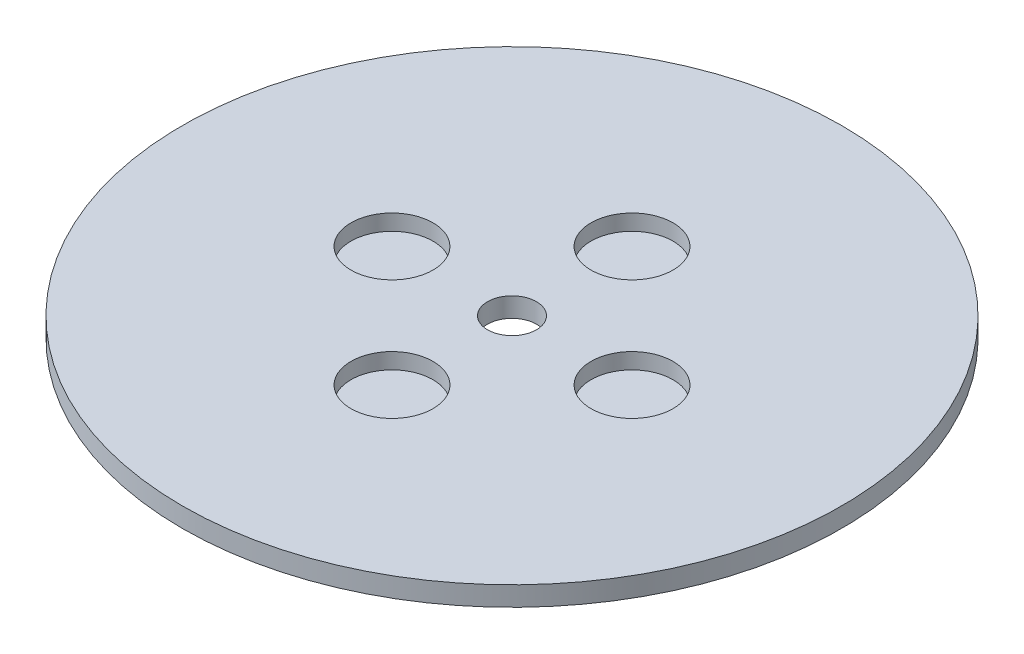
ISO-10303-21;
HEADER;
FILE_DESCRIPTION(('STEP AP214'),'2;1');
FILE_NAME('part.step','',(''),(''),'','','');
FILE_SCHEMA(('AUTOMOTIVE_DESIGN { 1 0 10303 214 1 1 1 1 }'));
ENDSEC;
DATA;
#1=APPLICATION_CONTEXT('core data for automotive mechanical design processes');
#2=APPLICATION_PROTOCOL_DEFINITION('international standard','automotive_design',2000,#1);
#3=PRODUCT_CONTEXT('',#1,'mechanical');
#4=PRODUCT('Part','Part','',(#3));
#5=PRODUCT_RELATED_PRODUCT_CATEGORY('part','',(#4));
#6=PRODUCT_DEFINITION_FORMATION('','',#4);
#7=PRODUCT_DEFINITION_CONTEXT('part definition',#1,'design');
#8=PRODUCT_DEFINITION('design','',#6,#7);
#9=PRODUCT_DEFINITION_SHAPE('','',#8);
#10=(LENGTH_UNIT() NAMED_UNIT(*) SI_UNIT(.MILLI.,.METRE.));
#11=(NAMED_UNIT(*) PLANE_ANGLE_UNIT() SI_UNIT($,.RADIAN.));
#12=(NAMED_UNIT(*) SI_UNIT($,.STERADIAN.) SOLID_ANGLE_UNIT());
#13=UNCERTAINTY_MEASURE_WITH_UNIT(LENGTH_MEASURE(1.E-05),#10,'distance_accuracy_value','');
#14=(GEOMETRIC_REPRESENTATION_CONTEXT(3) GLOBAL_UNCERTAINTY_ASSIGNED_CONTEXT((#13)) GLOBAL_UNIT_ASSIGNED_CONTEXT((#10,
#11,#12)) REPRESENTATION_CONTEXT('',''));
#15=CARTESIAN_POINT('',(0.,0.,0.));
#16=DIRECTION('',(0.,0.,1.));
#17=DIRECTION('',(1.,0.,0.));
#18=AXIS2_PLACEMENT_3D('',#15,#16,#17);
#19=CARTESIAN_POINT('',(0.,4.,0.));
#20=DIRECTION('',(0.,-1.,0.));
#21=DIRECTION('',(0.,0.,-1.));
#22=AXIS2_PLACEMENT_3D('',#19,#20,#21);
#23=CYLINDRICAL_SURFACE('',#22,67.5);
#24=CARTESIAN_POINT('',(0.,4.,0.));
#25=DIRECTION('',(0.,1.,0.));
#26=DIRECTION('',(0.,0.,1.));
#27=AXIS2_PLACEMENT_3D('',#24,#25,#26);
#28=CIRCLE('',#27,67.5);
#29=CARTESIAN_POINT('',(0.,4.,67.5));
#30=VERTEX_POINT('',#29);
#31=EDGE_CURVE('E10',#30,#30,#28,.T.);
#32=ORIENTED_EDGE('',*,*,#31,.F.);
#33=EDGE_LOOP('',(#32));
#34=FACE_BOUND('',#33,.T.);
#35=CARTESIAN_POINT('',(0.,0.,0.));
#36=DIRECTION('',(0.,1.,0.));
#37=DIRECTION('',(0.,0.,1.));
#38=AXIS2_PLACEMENT_3D('',#35,#36,#37);
#39=CIRCLE('',#38,67.5);
#40=CARTESIAN_POINT('',(0.,0.,67.5));
#41=VERTEX_POINT('',#40);
#42=EDGE_CURVE('E37',#41,#41,#39,.T.);
#43=ORIENTED_EDGE('',*,*,#42,.T.);
#44=EDGE_LOOP('',(#43));
#45=FACE_BOUND('',#44,.T.);
#46=ADVANCED_FACE('F40',(#34,#45),#23,.T.);
#47=CARTESIAN_POINT('',(0.,4.,0.));
#48=DIRECTION('',(0.,1.,0.));
#49=DIRECTION('',(0.,0.,1.));
#50=AXIS2_PLACEMENT_3D('',#47,#48,#49);
#51=PLANE('',#50);
#52=CARTESIAN_POINT('',(0.,4.,24.5816091397367));
#53=DIRECTION('',(0.,1.,0.));
#54=DIRECTION('',(1.,0.,0.));
#55=AXIS2_PLACEMENT_3D('',#52,#53,#54);
#56=CIRCLE('',#55,8.39665755798761);
#57=CARTESIAN_POINT('',(8.3966575579877,4.,24.5816091397367));
#58=VERTEX_POINT('',#57);
#59=EDGE_CURVE('E71',#58,#58,#56,.T.);
#60=ORIENTED_EDGE('',*,*,#59,.F.);
#61=EDGE_LOOP('',(#60));
#62=FACE_BOUND('',#61,.T.);
#63=CARTESIAN_POINT('',(24.5816091397367,4.,0.));
#64=DIRECTION('',(0.,1.,0.));
#65=DIRECTION('',(0.,0.,-1.));
#66=AXIS2_PLACEMENT_3D('',#63,#64,#65);
#67=CIRCLE('',#66,8.39665755798761);
#68=CARTESIAN_POINT('',(24.5816091397367,4.,-8.39665755798761));
#69=VERTEX_POINT('',#68);
#70=EDGE_CURVE('E70',#69,#69,#67,.T.);
#71=ORIENTED_EDGE('',*,*,#70,.F.);
#72=EDGE_LOOP('',(#71));
#73=FACE_BOUND('',#72,.T.);
#74=CARTESIAN_POINT('',(-2.57478688770379E-13,4.,-24.5816091397367));
#75=DIRECTION('',(0.,1.,0.));
#76=DIRECTION('',(-1.,0.,0.));
#77=AXIS2_PLACEMENT_3D('',#74,#75,#76);
#78=CIRCLE('',#77,8.39665755798761);
#79=CARTESIAN_POINT('',(-8.39665755798787,4.,-24.5816091397366));
#80=VERTEX_POINT('',#79);
#81=EDGE_CURVE('E61',#80,#80,#78,.T.);
#82=ORIENTED_EDGE('',*,*,#81,.F.);
#83=EDGE_LOOP('',(#82));
#84=FACE_BOUND('',#83,.T.);
#85=CARTESIAN_POINT('',(-24.5816091397367,4.,0.));
#86=DIRECTION('',(0.,1.,0.));
#87=DIRECTION('',(0.,0.,1.));
#88=AXIS2_PLACEMENT_3D('',#85,#86,#87);
#89=CIRCLE('',#88,8.39665755798761);
#90=CARTESIAN_POINT('',(-24.5816091397367,4.,8.39665755798761));
#91=VERTEX_POINT('',#90);
#92=EDGE_CURVE('E54',#91,#91,#89,.T.);
#93=ORIENTED_EDGE('',*,*,#92,.F.);
#94=EDGE_LOOP('',(#93));
#95=FACE_BOUND('',#94,.T.);
#96=CARTESIAN_POINT('',(0.,4.,0.));
#97=DIRECTION('',(0.,1.,0.));
#98=DIRECTION('',(0.,0.,1.));
#99=AXIS2_PLACEMENT_3D('',#96,#97,#98);
#100=CIRCLE('',#99,5.);
#101=CARTESIAN_POINT('',(0.,4.,5.));
#102=VERTEX_POINT('',#101);
#103=EDGE_CURVE('E50',#102,#102,#100,.T.);
#104=ORIENTED_EDGE('',*,*,#103,.F.);
#105=EDGE_LOOP('',(#104));
#106=FACE_BOUND('',#105,.T.);
#107=ORIENTED_EDGE('',*,*,#31,.T.);
#108=EDGE_LOOP('',(#107));
#109=FACE_BOUND('',#108,.T.);
#110=ADVANCED_FACE('F86',(#62,#73,#84,#95,#106,#109),#51,.T.);
#111=CARTESIAN_POINT('',(0.,0.,0.));
#112=DIRECTION('',(0.,1.,0.));
#113=DIRECTION('',(0.,0.,1.));
#114=AXIS2_PLACEMENT_3D('',#111,#112,#113);
#115=PLANE('',#114);
#116=CARTESIAN_POINT('',(0.,0.,0.));
#117=DIRECTION('',(0.,1.,0.));
#118=DIRECTION('',(0.,0.,1.));
#119=AXIS2_PLACEMENT_3D('',#116,#117,#118);
#120=CIRCLE('',#119,5.);
#121=CARTESIAN_POINT('',(0.,0.,5.));
#122=VERTEX_POINT('',#121);
#123=EDGE_CURVE('E47',#122,#122,#120,.T.);
#124=ORIENTED_EDGE('',*,*,#123,.T.);
#125=EDGE_LOOP('',(#124));
#126=FACE_BOUND('',#125,.T.);
#127=ORIENTED_EDGE('',*,*,#42,.F.);
#128=EDGE_LOOP('',(#127));
#129=FACE_BOUND('',#128,.T.);
#130=ADVANCED_FACE('F93',(#126,#129),#115,.F.);
#131=CARTESIAN_POINT('',(0.,4.,0.));
#132=DIRECTION('',(0.,-1.,0.));
#133=DIRECTION('',(0.,0.,-1.));
#134=AXIS2_PLACEMENT_3D('',#131,#132,#133);
#135=CYLINDRICAL_SURFACE('',#134,5.);
#136=ORIENTED_EDGE('',*,*,#103,.T.);
#137=EDGE_LOOP('',(#136));
#138=FACE_BOUND('',#137,.T.);
#139=ORIENTED_EDGE('',*,*,#123,.F.);
#140=EDGE_LOOP('',(#139));
#141=FACE_BOUND('',#140,.T.);
#142=ADVANCED_FACE('F101',(#138,#141),#135,.F.);
#143=CARTESIAN_POINT('',(-24.5816091397367,0.748964801806706,0.));
#144=DIRECTION('',(0.,1.,0.));
#145=DIRECTION('',(0.,0.,1.));
#146=AXIS2_PLACEMENT_3D('',#143,#144,#145);
#147=CYLINDRICAL_SURFACE('',#146,8.39665755798761);
#148=CARTESIAN_POINT('',(-24.5816091397367,0.748964801806706,0.));
#149=DIRECTION('',(0.,1.,0.));
#150=DIRECTION('',(0.,0.,1.));
#151=AXIS2_PLACEMENT_3D('',#148,#149,#150);
#152=CIRCLE('',#151,8.39665755798761);
#153=CARTESIAN_POINT('',(-24.5816091397367,0.748964801806706,8.39665755798761));
#154=VERTEX_POINT('',#153);
#155=EDGE_CURVE('E55',#154,#154,#152,.T.);
#156=ORIENTED_EDGE('',*,*,#155,.F.);
#157=EDGE_LOOP('',(#156));
#158=FACE_BOUND('',#157,.T.);
#159=ORIENTED_EDGE('',*,*,#92,.T.);
#160=EDGE_LOOP('',(#159));
#161=FACE_BOUND('',#160,.T.);
#162=ADVANCED_FACE('F102',(#158,#161),#147,.F.);
#163=CARTESIAN_POINT('',(-24.5816091397367,0.748964801806706,0.));
#164=DIRECTION('',(0.,1.,0.));
#165=DIRECTION('',(0.,0.,1.));
#166=AXIS2_PLACEMENT_3D('',#163,#164,#165);
#167=PLANE('',#166);
#168=ORIENTED_EDGE('',*,*,#155,.T.);
#169=EDGE_LOOP('',(#168));
#170=FACE_BOUND('',#169,.T.);
#171=ADVANCED_FACE('F133',(#170),#167,.T.);
#172=CARTESIAN_POINT('',(-2.57478688770379E-13,0.748964801806706,-24.5816091397367));
#173=DIRECTION('',(0.,1.,0.));
#174=DIRECTION('',(0.,0.,1.));
#175=AXIS2_PLACEMENT_3D('',#172,#173,#174);
#176=CYLINDRICAL_SURFACE('',#175,8.39665755798761);
#177=CARTESIAN_POINT('',(-2.57478688770379E-13,0.748964801806706,-24.5816091397367));
#178=DIRECTION('',(0.,1.,0.));
#179=DIRECTION('',(-1.,0.,0.));
#180=AXIS2_PLACEMENT_3D('',#177,#178,#179);
#181=CIRCLE('',#180,8.39665755798761);
#182=CARTESIAN_POINT('',(-8.39665755798787,0.748964801806706,-24.5816091397366));
#183=VERTEX_POINT('',#182);
#184=EDGE_CURVE('E63',#183,#183,#181,.T.);
#185=ORIENTED_EDGE('',*,*,#184,.F.);
#186=EDGE_LOOP('',(#185));
#187=FACE_BOUND('',#186,.T.);
#188=ORIENTED_EDGE('',*,*,#81,.T.);
#189=EDGE_LOOP('',(#188));
#190=FACE_BOUND('',#189,.T.);
#191=ADVANCED_FACE('F142',(#187,#190),#176,.F.);
#192=CARTESIAN_POINT('',(-2.57478688770379E-13,0.748964801806706,-24.5816091397367));
#193=DIRECTION('',(0.,1.,0.));
#194=DIRECTION('',(-1.,0.,0.));
#195=AXIS2_PLACEMENT_3D('',#192,#193,#194);
#196=PLANE('',#195);
#197=ORIENTED_EDGE('',*,*,#184,.T.);
#198=EDGE_LOOP('',(#197));
#199=FACE_BOUND('',#198,.T.);
#200=ADVANCED_FACE('F156',(#199),#196,.T.);
#201=CARTESIAN_POINT('',(24.5816091397367,0.748964801806706,0.));
#202=DIRECTION('',(0.,1.,0.));
#203=DIRECTION('',(0.,0.,1.));
#204=AXIS2_PLACEMENT_3D('',#201,#202,#203);
#205=CYLINDRICAL_SURFACE('',#204,8.39665755798761);
#206=CARTESIAN_POINT('',(24.5816091397367,0.748964801806706,0.));
#207=DIRECTION('',(0.,1.,0.));
#208=DIRECTION('',(0.,0.,-1.));
#209=AXIS2_PLACEMENT_3D('',#206,#207,#208);
#210=CIRCLE('',#209,8.39665755798761);
#211=CARTESIAN_POINT('',(24.5816091397367,0.748964801806706,-8.39665755798761));
#212=VERTEX_POINT('',#211);
#213=EDGE_CURVE('E69',#212,#212,#210,.T.);
#214=ORIENTED_EDGE('',*,*,#213,.F.);
#215=EDGE_LOOP('',(#214));
#216=FACE_BOUND('',#215,.T.);
#217=ORIENTED_EDGE('',*,*,#70,.T.);
#218=EDGE_LOOP('',(#217));
#219=FACE_BOUND('',#218,.T.);
#220=ADVANCED_FACE('F164',(#216,#219),#205,.F.);
#221=CARTESIAN_POINT('',(24.5816091397367,0.748964801806706,0.));
#222=DIRECTION('',(0.,1.,0.));
#223=DIRECTION('',(0.,0.,-1.));
#224=AXIS2_PLACEMENT_3D('',#221,#222,#223);
#225=PLANE('',#224);
#226=ORIENTED_EDGE('',*,*,#213,.T.);
#227=EDGE_LOOP('',(#226));
#228=FACE_BOUND('',#227,.T.);
#229=ADVANCED_FACE('F83',(#228),#225,.T.);
#230=CARTESIAN_POINT('',(0.,0.748964801806706,24.5816091397367));
#231=DIRECTION('',(0.,1.,0.));
#232=DIRECTION('',(0.,0.,1.));
#233=AXIS2_PLACEMENT_3D('',#230,#231,#232);
#234=CYLINDRICAL_SURFACE('',#233,8.39665755798761);
#235=CARTESIAN_POINT('',(0.,0.748964801806706,24.5816091397367));
#236=DIRECTION('',(0.,1.,0.));
#237=DIRECTION('',(1.,0.,0.));
#238=AXIS2_PLACEMENT_3D('',#235,#236,#237);
#239=CIRCLE('',#238,8.39665755798761);
#240=CARTESIAN_POINT('',(8.3966575579877,0.748964801806706,24.5816091397367));
#241=VERTEX_POINT('',#240);
#242=EDGE_CURVE('E59',#241,#241,#239,.T.);
#243=ORIENTED_EDGE('',*,*,#242,.F.);
#244=EDGE_LOOP('',(#243));
#245=FACE_BOUND('',#244,.T.);
#246=ORIENTED_EDGE('',*,*,#59,.T.);
#247=EDGE_LOOP('',(#246));
#248=FACE_BOUND('',#247,.T.);
#249=ADVANCED_FACE('F81',(#245,#248),#234,.F.);
#250=CARTESIAN_POINT('',(0.,0.748964801806706,24.5816091397367));
#251=DIRECTION('',(0.,1.,0.));
#252=DIRECTION('',(1.,0.,0.));
#253=AXIS2_PLACEMENT_3D('',#250,#251,#252);
#254=PLANE('',#253);
#255=ORIENTED_EDGE('',*,*,#242,.T.);
#256=EDGE_LOOP('',(#255));
#257=FACE_BOUND('',#256,.T.);
#258=ADVANCED_FACE('F78',(#257),#254,.T.);
#259=CLOSED_SHELL('',(#46,#110,#130,#142,#162,#171,#191,#200,#220,#229,#249,#258));
#260=MANIFOLD_SOLID_BREP('B2',#259);
#261=ADVANCED_BREP_SHAPE_REPRESENTATION('',(#18,#260),#14);
#262=SHAPE_DEFINITION_REPRESENTATION(#9,#261);
ENDSEC;
END-ISO-10303-21;
